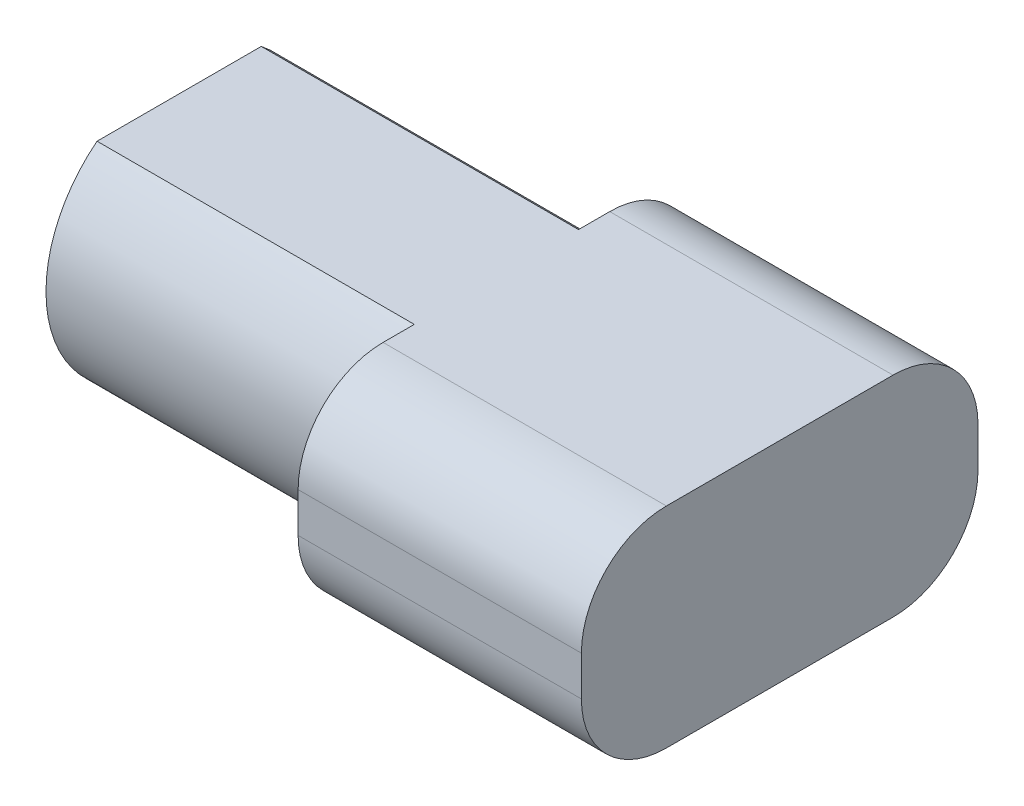
ISO-10303-21;
HEADER;
FILE_DESCRIPTION(('STEP AP214'),'2;1');
FILE_NAME('part.step','',(''),(''),'','','');
FILE_SCHEMA(('AUTOMOTIVE_DESIGN { 1 0 10303 214 1 1 1 1 }'));
ENDSEC;
DATA;
#1=APPLICATION_CONTEXT('core data for automotive mechanical design processes');
#2=APPLICATION_PROTOCOL_DEFINITION('international standard','automotive_design',2000,#1);
#3=PRODUCT_CONTEXT('',#1,'mechanical');
#4=PRODUCT('Part','Part','',(#3));
#5=PRODUCT_RELATED_PRODUCT_CATEGORY('part','',(#4));
#6=PRODUCT_DEFINITION_FORMATION('','',#4);
#7=PRODUCT_DEFINITION_CONTEXT('part definition',#1,'design');
#8=PRODUCT_DEFINITION('design','',#6,#7);
#9=PRODUCT_DEFINITION_SHAPE('','',#8);
#10=(LENGTH_UNIT() NAMED_UNIT(*) SI_UNIT(.MILLI.,.METRE.));
#11=(NAMED_UNIT(*) PLANE_ANGLE_UNIT() SI_UNIT($,.RADIAN.));
#12=(NAMED_UNIT(*) SI_UNIT($,.STERADIAN.) SOLID_ANGLE_UNIT());
#13=UNCERTAINTY_MEASURE_WITH_UNIT(LENGTH_MEASURE(1.E-05),#10,'distance_accuracy_value','');
#14=(GEOMETRIC_REPRESENTATION_CONTEXT(3) GLOBAL_UNCERTAINTY_ASSIGNED_CONTEXT((#13)) GLOBAL_UNIT_ASSIGNED_CONTEXT((#10,
#11,#12)) REPRESENTATION_CONTEXT('',''));
#15=CARTESIAN_POINT('',(0.,0.,0.));
#16=DIRECTION('',(0.,0.,1.));
#17=DIRECTION('',(1.,0.,0.));
#18=AXIS2_PLACEMENT_3D('',#15,#16,#17);
#19=CARTESIAN_POINT('',(5.6,0.,0.));
#20=DIRECTION('',(-1.,0.,0.));
#21=DIRECTION('',(0.,0.,1.));
#22=AXIS2_PLACEMENT_3D('',#19,#20,#21);
#23=CYLINDRICAL_SURFACE('',#22,2.35);
#24=CARTESIAN_POINT('',(0.,0.,0.));
#25=DIRECTION('',(1.,0.,0.));
#26=DIRECTION('',(0.,0.,-1.));
#27=AXIS2_PLACEMENT_3D('',#24,#25,#26);
#28=CIRCLE('',#27,2.35);
#29=CARTESIAN_POINT('',(0.,1.85,1.44913767461894));
#30=VERTEX_POINT('',#29);
#31=CARTESIAN_POINT('',(0.,-1.85,1.44913767461894));
#32=VERTEX_POINT('',#31);
#33=EDGE_CURVE('E168',#30,#32,#28,.T.);
#34=ORIENTED_EDGE('',*,*,#33,.T.);
#35=DIRECTION('',(-1.,0.,0.));
#36=VECTOR('',#35,1.);
#37=CARTESIAN_POINT('',(5.6,-1.85,1.44913767461894));
#38=LINE('',#37,#36);
#39=CARTESIAN_POINT('',(5.6,-1.85,1.44913767461894));
#40=VERTEX_POINT('',#39);
#41=EDGE_CURVE('E185',#40,#32,#38,.T.);
#42=ORIENTED_EDGE('',*,*,#41,.F.);
#43=CARTESIAN_POINT('',(5.6,0.,0.));
#44=DIRECTION('',(1.,0.,0.));
#45=DIRECTION('',(0.,0.,-1.));
#46=AXIS2_PLACEMENT_3D('',#43,#44,#45);
#47=CIRCLE('',#46,2.35);
#48=CARTESIAN_POINT('',(5.6,1.85,1.44913767461894));
#49=VERTEX_POINT('',#48);
#50=EDGE_CURVE('E151',#49,#40,#47,.T.);
#51=ORIENTED_EDGE('',*,*,#50,.F.);
#52=DIRECTION('',(-1.,0.,0.));
#53=VECTOR('',#52,1.);
#54=CARTESIAN_POINT('',(5.6,1.85,1.44913767461894));
#55=LINE('',#54,#53);
#56=EDGE_CURVE('E145',#49,#30,#55,.T.);
#57=ORIENTED_EDGE('',*,*,#56,.T.);
#58=EDGE_LOOP('',(#34,#42,#51,#57));
#59=FACE_BOUND('',#58,.T.);
#60=ADVANCED_FACE('F32',(#59),#23,.T.);
#61=CARTESIAN_POINT('',(5.6,-1.85,1.44913767461894));
#62=DIRECTION('',(0.,1.,0.));
#63=DIRECTION('',(0.,0.,1.));
#64=AXIS2_PLACEMENT_3D('',#61,#62,#63);
#65=PLANE('',#64);
#66=DIRECTION('',(0.,0.,-1.));
#67=VECTOR('',#66,1.);
#68=CARTESIAN_POINT('',(5.6,-1.85,-1.44913767461894));
#69=LINE('',#68,#67);
#70=CARTESIAN_POINT('',(5.6,-1.85,-1.44913767461894));
#71=VERTEX_POINT('',#70);
#72=CARTESIAN_POINT('',(5.6,-1.85,-2.));
#73=VERTEX_POINT('',#72);
#74=EDGE_CURVE('E150',#71,#73,#69,.T.);
#75=ORIENTED_EDGE('',*,*,#74,.T.);
#76=DIRECTION('',(-1.,0.,0.));
#77=VECTOR('',#76,1.);
#78=CARTESIAN_POINT('',(5.6,-1.85,-2.));
#79=LINE('',#78,#77);
#80=CARTESIAN_POINT('',(10.6,-1.85,-2.));
#81=VERTEX_POINT('',#80);
#82=EDGE_CURVE('E219',#73,#81,#79,.F.);
#83=ORIENTED_EDGE('',*,*,#82,.T.);
#84=DIRECTION('',(0.,0.,-1.));
#85=VECTOR('',#84,1.);
#86=CARTESIAN_POINT('',(10.6,-1.85,3.5));
#87=LINE('',#86,#85);
#88=CARTESIAN_POINT('',(10.6,-1.85,2.));
#89=VERTEX_POINT('',#88);
#90=EDGE_CURVE('E250',#89,#81,#87,.T.);
#91=ORIENTED_EDGE('',*,*,#90,.F.);
#92=DIRECTION('',(-1.,0.,0.));
#93=VECTOR('',#92,1.);
#94=CARTESIAN_POINT('',(5.6,-1.85,2.));
#95=LINE('',#94,#93);
#96=CARTESIAN_POINT('',(5.6,-1.85,2.));
#97=VERTEX_POINT('',#96);
#98=EDGE_CURVE('E217',#89,#97,#95,.T.);
#99=ORIENTED_EDGE('',*,*,#98,.T.);
#100=EDGE_CURVE('E188',#97,#40,#69,.T.);
#101=ORIENTED_EDGE('',*,*,#100,.T.);
#102=ORIENTED_EDGE('',*,*,#41,.T.);
#103=DIRECTION('',(0.,0.,-1.));
#104=VECTOR('',#103,1.);
#105=CARTESIAN_POINT('',(0.,-1.85,1.44913767461894));
#106=LINE('',#105,#104);
#107=CARTESIAN_POINT('',(0.,-1.85,-1.44913767461894));
#108=VERTEX_POINT('',#107);
#109=EDGE_CURVE('E171',#32,#108,#106,.T.);
#110=ORIENTED_EDGE('',*,*,#109,.T.);
#111=DIRECTION('',(-1.,0.,0.));
#112=VECTOR('',#111,1.);
#113=CARTESIAN_POINT('',(5.6,-1.85,-1.44913767461894));
#114=LINE('',#113,#112);
#115=EDGE_CURVE('E144',#71,#108,#114,.T.);
#116=ORIENTED_EDGE('',*,*,#115,.F.);
#117=EDGE_LOOP('',(#75,#83,#91,#99,#101,#102,#110,#116));
#118=FACE_BOUND('',#117,.T.);
#119=ADVANCED_FACE('F186',(#118),#65,.F.);
#120=CARTESIAN_POINT('',(5.6,0.,0.));
#121=DIRECTION('',(-1.,0.,0.));
#122=DIRECTION('',(0.,0.,1.));
#123=AXIS2_PLACEMENT_3D('',#120,#121,#122);
#124=CYLINDRICAL_SURFACE('',#123,2.35);
#125=CARTESIAN_POINT('',(0.,0.,0.));
#126=DIRECTION('',(1.,0.,0.));
#127=DIRECTION('',(0.,0.,-1.));
#128=AXIS2_PLACEMENT_3D('',#125,#126,#127);
#129=CIRCLE('',#128,2.35);
#130=CARTESIAN_POINT('',(0.,1.85,-1.44913767461894));
#131=VERTEX_POINT('',#130);
#132=EDGE_CURVE('E143',#108,#131,#129,.T.);
#133=ORIENTED_EDGE('',*,*,#132,.T.);
#134=DIRECTION('',(-1.,0.,0.));
#135=VECTOR('',#134,1.);
#136=CARTESIAN_POINT('',(5.6,1.85,-1.44913767461894));
#137=LINE('',#136,#135);
#138=CARTESIAN_POINT('',(5.6,1.85,-1.44913767461894));
#139=VERTEX_POINT('',#138);
#140=EDGE_CURVE('E127',#139,#131,#137,.T.);
#141=ORIENTED_EDGE('',*,*,#140,.F.);
#142=CARTESIAN_POINT('',(5.6,0.,0.));
#143=DIRECTION('',(1.,0.,0.));
#144=DIRECTION('',(0.,0.,-1.));
#145=AXIS2_PLACEMENT_3D('',#142,#143,#144);
#146=CIRCLE('',#145,2.35);
#147=EDGE_CURVE('E140',#71,#139,#146,.T.);
#148=ORIENTED_EDGE('',*,*,#147,.F.);
#149=ORIENTED_EDGE('',*,*,#115,.T.);
#150=EDGE_LOOP('',(#133,#141,#148,#149));
#151=FACE_BOUND('',#150,.T.);
#152=ADVANCED_FACE('F138',(#151),#124,.T.);
#153=CARTESIAN_POINT('',(5.6,1.85,1.44913767461894));
#154=DIRECTION('',(0.,-1.,0.));
#155=DIRECTION('',(0.,0.,-1.));
#156=AXIS2_PLACEMENT_3D('',#153,#154,#155);
#157=PLANE('',#156);
#158=DIRECTION('',(0.,0.,1.));
#159=VECTOR('',#158,1.);
#160=CARTESIAN_POINT('',(10.6,1.85,0.));
#161=LINE('',#160,#159);
#162=CARTESIAN_POINT('',(10.6,1.85,-2.));
#163=VERTEX_POINT('',#162);
#164=CARTESIAN_POINT('',(10.6,1.85,2.));
#165=VERTEX_POINT('',#164);
#166=EDGE_CURVE('E246',#163,#165,#161,.T.);
#167=ORIENTED_EDGE('',*,*,#166,.F.);
#168=DIRECTION('',(-1.,0.,0.));
#169=VECTOR('',#168,1.);
#170=CARTESIAN_POINT('',(5.6,1.85,-2.));
#171=LINE('',#170,#169);
#172=CARTESIAN_POINT('',(5.6,1.85,-2.));
#173=VERTEX_POINT('',#172);
#174=EDGE_CURVE('E130',#163,#173,#171,.T.);
#175=ORIENTED_EDGE('',*,*,#174,.T.);
#176=DIRECTION('',(0.,0.,1.));
#177=VECTOR('',#176,1.);
#178=CARTESIAN_POINT('',(5.6,1.85,0.));
#179=LINE('',#178,#177);
#180=EDGE_CURVE('E123',#173,#139,#179,.T.);
#181=ORIENTED_EDGE('',*,*,#180,.T.);
#182=ORIENTED_EDGE('',*,*,#140,.T.);
#183=DIRECTION('',(0.,0.,1.));
#184=VECTOR('',#183,1.);
#185=CARTESIAN_POINT('',(0.,1.85,1.44913767461894));
#186=LINE('',#185,#184);
#187=EDGE_CURVE('E156',#131,#30,#186,.T.);
#188=ORIENTED_EDGE('',*,*,#187,.T.);
#189=ORIENTED_EDGE('',*,*,#56,.F.);
#190=CARTESIAN_POINT('',(5.6,1.85,2.));
#191=VERTEX_POINT('',#190);
#192=EDGE_CURVE('E134',#49,#191,#179,.T.);
#193=ORIENTED_EDGE('',*,*,#192,.T.);
#194=DIRECTION('',(-1.,0.,0.));
#195=VECTOR('',#194,1.);
#196=CARTESIAN_POINT('',(5.6,1.85,2.));
#197=LINE('',#196,#195);
#198=EDGE_CURVE('E229',#191,#165,#197,.F.);
#199=ORIENTED_EDGE('',*,*,#198,.T.);
#200=EDGE_LOOP('',(#167,#175,#181,#182,#188,#189,#193,#199));
#201=FACE_BOUND('',#200,.T.);
#202=ADVANCED_FACE('F126',(#201),#157,.F.);
#203=CARTESIAN_POINT('',(0.,0.,0.));
#204=DIRECTION('',(1.,0.,0.));
#205=DIRECTION('',(0.,0.,-1.));
#206=AXIS2_PLACEMENT_3D('',#203,#204,#205);
#207=PLANE('',#206);
#208=ORIENTED_EDGE('',*,*,#33,.F.);
#209=ORIENTED_EDGE('',*,*,#187,.F.);
#210=ORIENTED_EDGE('',*,*,#132,.F.);
#211=ORIENTED_EDGE('',*,*,#109,.F.);
#212=EDGE_LOOP('',(#208,#209,#210,#211));
#213=FACE_BOUND('',#212,.T.);
#214=ADVANCED_FACE('F182',(#213),#207,.F.);
#215=CARTESIAN_POINT('',(5.6,1.85,-3.5));
#216=DIRECTION('',(1.,0.,0.));
#217=DIRECTION('',(0.,0.,-1.));
#218=AXIS2_PLACEMENT_3D('',#215,#216,#217);
#219=PLANE('',#218);
#220=ORIENTED_EDGE('',*,*,#100,.F.);
#221=CARTESIAN_POINT('',(5.6,-0.35,2.));
#222=DIRECTION('',(1.,0.,0.));
#223=DIRECTION('',(0.,0.,-1.));
#224=AXIS2_PLACEMENT_3D('',#221,#222,#223);
#225=CIRCLE('',#224,1.5);
#226=CARTESIAN_POINT('',(5.6,-0.35,3.5));
#227=VERTEX_POINT('',#226);
#228=EDGE_CURVE('E47',#97,#227,#225,.F.);
#229=ORIENTED_EDGE('',*,*,#228,.T.);
#230=DIRECTION('',(0.,-1.,0.));
#231=VECTOR('',#230,1.);
#232=CARTESIAN_POINT('',(5.6,1.85,3.5));
#233=LINE('',#232,#231);
#234=CARTESIAN_POINT('',(5.6,0.35,3.5));
#235=VERTEX_POINT('',#234);
#236=EDGE_CURVE('E133',#235,#227,#233,.T.);
#237=ORIENTED_EDGE('',*,*,#236,.F.);
#238=CARTESIAN_POINT('',(5.6,0.35,2.));
#239=DIRECTION('',(1.,0.,0.));
#240=DIRECTION('',(0.,0.,-1.));
#241=AXIS2_PLACEMENT_3D('',#238,#239,#240);
#242=CIRCLE('',#241,1.5);
#243=EDGE_CURVE('E55',#235,#191,#242,.F.);
#244=ORIENTED_EDGE('',*,*,#243,.T.);
#245=ORIENTED_EDGE('',*,*,#192,.F.);
#246=ORIENTED_EDGE('',*,*,#50,.T.);
#247=EDGE_LOOP('',(#220,#229,#237,#244,#245,#246));
#248=FACE_BOUND('',#247,.T.);
#249=ADVANCED_FACE('F240',(#248),#219,.F.);
#250=DIRECTION('',(0.,1.,0.));
#251=VECTOR('',#250,1.);
#252=CARTESIAN_POINT('',(5.6,-1.85,-3.5));
#253=LINE('',#252,#251);
#254=CARTESIAN_POINT('',(5.6,-0.35,-3.5));
#255=VERTEX_POINT('',#254);
#256=CARTESIAN_POINT('',(5.6,0.35,-3.5));
#257=VERTEX_POINT('',#256);
#258=EDGE_CURVE('E211',#255,#257,#253,.T.);
#259=ORIENTED_EDGE('',*,*,#258,.F.);
#260=CARTESIAN_POINT('',(5.6,-0.35,-2.));
#261=DIRECTION('',(1.,0.,0.));
#262=DIRECTION('',(0.,0.,-1.));
#263=AXIS2_PLACEMENT_3D('',#260,#261,#262);
#264=CIRCLE('',#263,1.5);
#265=EDGE_CURVE('E216',#255,#73,#264,.F.);
#266=ORIENTED_EDGE('',*,*,#265,.T.);
#267=ORIENTED_EDGE('',*,*,#74,.F.);
#268=ORIENTED_EDGE('',*,*,#147,.T.);
#269=ORIENTED_EDGE('',*,*,#180,.F.);
#270=CARTESIAN_POINT('',(5.6,0.35,-2.));
#271=DIRECTION('',(1.,0.,0.));
#272=DIRECTION('',(0.,0.,-1.));
#273=AXIS2_PLACEMENT_3D('',#270,#271,#272);
#274=CIRCLE('',#273,1.5);
#275=EDGE_CURVE('E199',#173,#257,#274,.F.);
#276=ORIENTED_EDGE('',*,*,#275,.T.);
#277=EDGE_LOOP('',(#259,#266,#267,#268,#269,#276));
#278=FACE_BOUND('',#277,.T.);
#279=ADVANCED_FACE('F148',(#278),#219,.F.);
#280=CARTESIAN_POINT('',(10.6,1.85,3.5));
#281=DIRECTION('',(0.,0.,-1.));
#282=DIRECTION('',(-1.,0.,0.));
#283=AXIS2_PLACEMENT_3D('',#280,#281,#282);
#284=PLANE('',#283);
#285=ORIENTED_EDGE('',*,*,#236,.T.);
#286=DIRECTION('',(-1.,0.,0.));
#287=VECTOR('',#286,1.);
#288=CARTESIAN_POINT('',(10.6,-0.35,3.5));
#289=LINE('',#288,#287);
#290=CARTESIAN_POINT('',(10.6,-0.35,3.5));
#291=VERTEX_POINT('',#290);
#292=EDGE_CURVE('E11',#227,#291,#289,.F.);
#293=ORIENTED_EDGE('',*,*,#292,.T.);
#294=DIRECTION('',(0.,-1.,0.));
#295=VECTOR('',#294,1.);
#296=CARTESIAN_POINT('',(10.6,1.85,3.5));
#297=LINE('',#296,#295);
#298=CARTESIAN_POINT('',(10.6,0.35,3.5));
#299=VERTEX_POINT('',#298);
#300=EDGE_CURVE('E238',#299,#291,#297,.T.);
#301=ORIENTED_EDGE('',*,*,#300,.F.);
#302=DIRECTION('',(-1.,0.,0.));
#303=VECTOR('',#302,1.);
#304=CARTESIAN_POINT('',(10.6,0.35,3.5));
#305=LINE('',#304,#303);
#306=EDGE_CURVE('E40',#299,#235,#305,.T.);
#307=ORIENTED_EDGE('',*,*,#306,.T.);
#308=EDGE_LOOP('',(#285,#293,#301,#307));
#309=FACE_BOUND('',#308,.T.);
#310=ADVANCED_FACE('F235',(#309),#284,.F.);
#311=CARTESIAN_POINT('',(10.6,-1.85,-3.5));
#312=DIRECTION('',(0.,0.,1.));
#313=DIRECTION('',(1.,0.,0.));
#314=AXIS2_PLACEMENT_3D('',#311,#312,#313);
#315=PLANE('',#314);
#316=DIRECTION('',(0.,1.,0.));
#317=VECTOR('',#316,1.);
#318=CARTESIAN_POINT('',(10.6,-1.85,-3.5));
#319=LINE('',#318,#317);
#320=CARTESIAN_POINT('',(10.6,-0.35,-3.5));
#321=VERTEX_POINT('',#320);
#322=CARTESIAN_POINT('',(10.6,0.35,-3.5));
#323=VERTEX_POINT('',#322);
#324=EDGE_CURVE('E172',#321,#323,#319,.T.);
#325=ORIENTED_EDGE('',*,*,#324,.F.);
#326=DIRECTION('',(-1.,0.,0.));
#327=VECTOR('',#326,1.);
#328=CARTESIAN_POINT('',(10.6,-0.35,-3.5));
#329=LINE('',#328,#327);
#330=EDGE_CURVE('E191',#321,#255,#329,.T.);
#331=ORIENTED_EDGE('',*,*,#330,.T.);
#332=ORIENTED_EDGE('',*,*,#258,.T.);
#333=DIRECTION('',(-1.,0.,0.));
#334=VECTOR('',#333,1.);
#335=CARTESIAN_POINT('',(10.6,0.35,-3.5));
#336=LINE('',#335,#334);
#337=EDGE_CURVE('E189',#257,#323,#336,.F.);
#338=ORIENTED_EDGE('',*,*,#337,.T.);
#339=EDGE_LOOP('',(#325,#331,#332,#338));
#340=FACE_BOUND('',#339,.T.);
#341=ADVANCED_FACE('F264',(#340),#315,.F.);
#342=CARTESIAN_POINT('',(10.6,1.85,-3.5));
#343=DIRECTION('',(1.,0.,0.));
#344=DIRECTION('',(0.,0.,-1.));
#345=AXIS2_PLACEMENT_3D('',#342,#343,#344);
#346=PLANE('',#345);
#347=ORIENTED_EDGE('',*,*,#90,.T.);
#348=CARTESIAN_POINT('',(10.6,-0.35,-2.));
#349=DIRECTION('',(1.,0.,0.));
#350=DIRECTION('',(0.,0.,-1.));
#351=AXIS2_PLACEMENT_3D('',#348,#349,#350);
#352=CIRCLE('',#351,1.5);
#353=EDGE_CURVE('E227',#81,#321,#352,.T.);
#354=ORIENTED_EDGE('',*,*,#353,.T.);
#355=ORIENTED_EDGE('',*,*,#324,.T.);
#356=CARTESIAN_POINT('',(10.6,0.35,-2.));
#357=DIRECTION('',(1.,0.,0.));
#358=DIRECTION('',(0.,0.,-1.));
#359=AXIS2_PLACEMENT_3D('',#356,#357,#358);
#360=CIRCLE('',#359,1.5);
#361=EDGE_CURVE('E225',#323,#163,#360,.T.);
#362=ORIENTED_EDGE('',*,*,#361,.T.);
#363=ORIENTED_EDGE('',*,*,#166,.T.);
#364=CARTESIAN_POINT('',(10.6,0.35,2.));
#365=DIRECTION('',(1.,0.,0.));
#366=DIRECTION('',(0.,0.,-1.));
#367=AXIS2_PLACEMENT_3D('',#364,#365,#366);
#368=CIRCLE('',#367,1.5);
#369=EDGE_CURVE('E221',#165,#299,#368,.T.);
#370=ORIENTED_EDGE('',*,*,#369,.T.);
#371=ORIENTED_EDGE('',*,*,#300,.T.);
#372=CARTESIAN_POINT('',(10.6,-0.35,2.));
#373=DIRECTION('',(1.,0.,0.));
#374=DIRECTION('',(0.,0.,-1.));
#375=AXIS2_PLACEMENT_3D('',#372,#373,#374);
#376=CIRCLE('',#375,1.5);
#377=EDGE_CURVE('E223',#291,#89,#376,.T.);
#378=ORIENTED_EDGE('',*,*,#377,.T.);
#379=EDGE_LOOP('',(#347,#354,#355,#362,#363,#370,#371,#378));
#380=FACE_BOUND('',#379,.T.);
#381=ADVANCED_FACE('F244',(#380),#346,.T.);
#382=CARTESIAN_POINT('',(10.6,-0.35,-2.));
#383=DIRECTION('',(-1.,0.,0.));
#384=DIRECTION('',(0.,0.,1.));
#385=AXIS2_PLACEMENT_3D('',#382,#383,#384);
#386=CYLINDRICAL_SURFACE('',#385,1.5);
#387=ORIENTED_EDGE('',*,*,#353,.F.);
#388=ORIENTED_EDGE('',*,*,#82,.F.);
#389=ORIENTED_EDGE('',*,*,#265,.F.);
#390=ORIENTED_EDGE('',*,*,#330,.F.);
#391=EDGE_LOOP('',(#387,#388,#389,#390));
#392=FACE_BOUND('',#391,.T.);
#393=ADVANCED_FACE('F263',(#392),#386,.T.);
#394=CARTESIAN_POINT('',(5.6,0.35,-2.));
#395=DIRECTION('',(-1.,0.,0.));
#396=DIRECTION('',(0.,0.,1.));
#397=AXIS2_PLACEMENT_3D('',#394,#395,#396);
#398=CYLINDRICAL_SURFACE('',#397,1.5);
#399=ORIENTED_EDGE('',*,*,#361,.F.);
#400=ORIENTED_EDGE('',*,*,#337,.F.);
#401=ORIENTED_EDGE('',*,*,#275,.F.);
#402=ORIENTED_EDGE('',*,*,#174,.F.);
#403=EDGE_LOOP('',(#399,#400,#401,#402));
#404=FACE_BOUND('',#403,.T.);
#405=ADVANCED_FACE('F260',(#404),#398,.T.);
#406=CARTESIAN_POINT('',(5.6,-0.35,2.));
#407=DIRECTION('',(-1.,0.,0.));
#408=DIRECTION('',(0.,0.,1.));
#409=AXIS2_PLACEMENT_3D('',#406,#407,#408);
#410=CYLINDRICAL_SURFACE('',#409,1.5);
#411=ORIENTED_EDGE('',*,*,#377,.F.);
#412=ORIENTED_EDGE('',*,*,#292,.F.);
#413=ORIENTED_EDGE('',*,*,#228,.F.);
#414=ORIENTED_EDGE('',*,*,#98,.F.);
#415=EDGE_LOOP('',(#411,#412,#413,#414));
#416=FACE_BOUND('',#415,.T.);
#417=ADVANCED_FACE('F285',(#416),#410,.T.);
#418=CARTESIAN_POINT('',(10.6,0.35,2.));
#419=DIRECTION('',(-1.,0.,0.));
#420=DIRECTION('',(0.,0.,1.));
#421=AXIS2_PLACEMENT_3D('',#418,#419,#420);
#422=CYLINDRICAL_SURFACE('',#421,1.5);
#423=ORIENTED_EDGE('',*,*,#369,.F.);
#424=ORIENTED_EDGE('',*,*,#198,.F.);
#425=ORIENTED_EDGE('',*,*,#243,.F.);
#426=ORIENTED_EDGE('',*,*,#306,.F.);
#427=EDGE_LOOP('',(#423,#424,#425,#426));
#428=FACE_BOUND('',#427,.T.);
#429=ADVANCED_FACE('F34',(#428),#422,.T.);
#430=CLOSED_SHELL('',(#60,#119,#152,#202,#214,#249,#279,#310,#341,#381,#393,#405,#417,#429));
#431=MANIFOLD_SOLID_BREP('B2',#430);
#432=ADVANCED_BREP_SHAPE_REPRESENTATION('',(#18,#431),#14);
#433=SHAPE_DEFINITION_REPRESENTATION(#9,#432);
ENDSEC;
END-ISO-10303-21;
